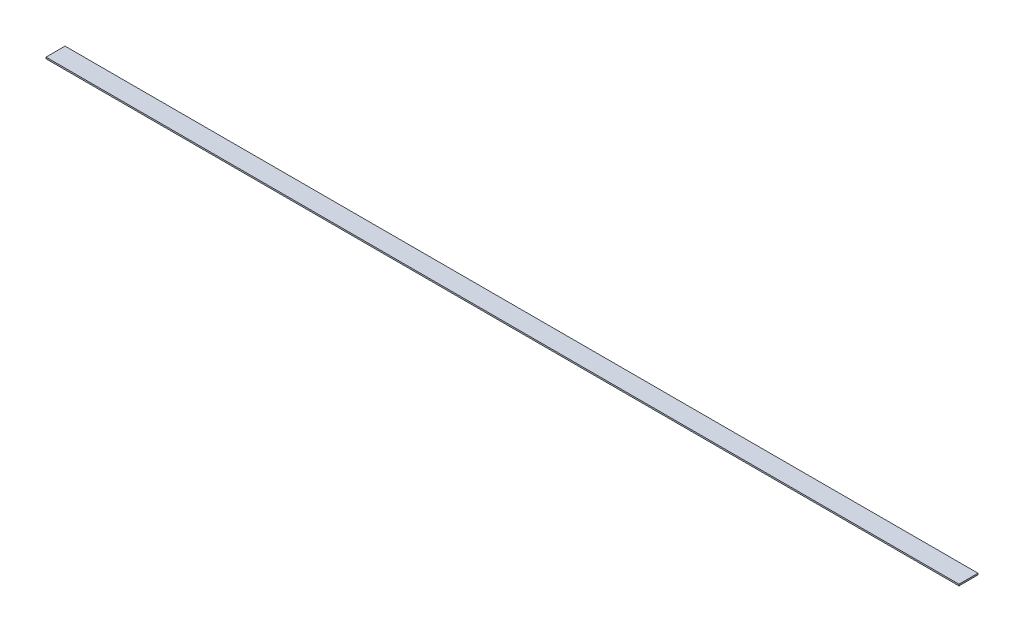
ISO-10303-21;
HEADER;
FILE_DESCRIPTION(('STEP AP214'),'2;1');
FILE_NAME('part.step','',(''),(''),'','','');
FILE_SCHEMA(('AUTOMOTIVE_DESIGN { 1 0 10303 214 1 1 1 1 }'));
ENDSEC;
DATA;
#1=APPLICATION_CONTEXT('core data for automotive mechanical design processes');
#2=APPLICATION_PROTOCOL_DEFINITION('international standard','automotive_design',2000,#1);
#3=PRODUCT_CONTEXT('',#1,'mechanical');
#4=PRODUCT('Part','Part','',(#3));
#5=PRODUCT_RELATED_PRODUCT_CATEGORY('part','',(#4));
#6=PRODUCT_DEFINITION_FORMATION('','',#4);
#7=PRODUCT_DEFINITION_CONTEXT('part definition',#1,'design');
#8=PRODUCT_DEFINITION('design','',#6,#7);
#9=PRODUCT_DEFINITION_SHAPE('','',#8);
#10=(LENGTH_UNIT() NAMED_UNIT(*) SI_UNIT(.MILLI.,.METRE.));
#11=(NAMED_UNIT(*) PLANE_ANGLE_UNIT() SI_UNIT($,.RADIAN.));
#12=(NAMED_UNIT(*) SI_UNIT($,.STERADIAN.) SOLID_ANGLE_UNIT());
#13=UNCERTAINTY_MEASURE_WITH_UNIT(LENGTH_MEASURE(1.E-05),#10,'distance_accuracy_value','');
#14=(GEOMETRIC_REPRESENTATION_CONTEXT(3) GLOBAL_UNCERTAINTY_ASSIGNED_CONTEXT((#13)) GLOBAL_UNIT_ASSIGNED_CONTEXT((#10,
#11,#12)) REPRESENTATION_CONTEXT('',''));
#15=CARTESIAN_POINT('',(0.,0.,0.));
#16=DIRECTION('',(0.,0.,1.));
#17=DIRECTION('',(1.,0.,0.));
#18=AXIS2_PLACEMENT_3D('',#15,#16,#17);
#19=CARTESIAN_POINT('',(-152.4,0.25,3.17500000000002));
#20=DIRECTION('',(1.,0.,0.));
#21=DIRECTION('',(0.,0.,-1.));
#22=AXIS2_PLACEMENT_3D('',#19,#20,#21);
#23=PLANE('',#22);
#24=DIRECTION('',(0.,0.,1.));
#25=VECTOR('',#24,1.);
#26=CARTESIAN_POINT('',(-152.4,-0.25,3.17500000000002));
#27=LINE('',#26,#25);
#28=CARTESIAN_POINT('',(-152.4,-0.25,-3.17499999999998));
#29=VERTEX_POINT('',#28);
#30=CARTESIAN_POINT('',(-152.4,-0.25,3.17500000000002));
#31=VERTEX_POINT('',#30);
#32=EDGE_CURVE('E107',#29,#31,#27,.T.);
#33=ORIENTED_EDGE('',*,*,#32,.T.);
#34=DIRECTION('',(0.,-1.,0.));
#35=VECTOR('',#34,1.);
#36=CARTESIAN_POINT('',(-152.4,0.25,3.17500000000002));
#37=LINE('',#36,#35);
#38=CARTESIAN_POINT('',(-152.4,0.25,3.17500000000002));
#39=VERTEX_POINT('',#38);
#40=EDGE_CURVE('E11',#39,#31,#37,.T.);
#41=ORIENTED_EDGE('',*,*,#40,.F.);
#42=DIRECTION('',(0.,0.,1.));
#43=VECTOR('',#42,1.);
#44=CARTESIAN_POINT('',(-152.4,0.25,3.17500000000002));
#45=LINE('',#44,#43);
#46=CARTESIAN_POINT('',(-152.4,0.25,-3.17499999999998));
#47=VERTEX_POINT('',#46);
#48=EDGE_CURVE('E91',#47,#39,#45,.T.);
#49=ORIENTED_EDGE('',*,*,#48,.F.);
#50=DIRECTION('',(0.,-1.,0.));
#51=VECTOR('',#50,1.);
#52=CARTESIAN_POINT('',(-152.4,0.25,-3.17499999999998));
#53=LINE('',#52,#51);
#54=EDGE_CURVE('E103',#47,#29,#53,.T.);
#55=ORIENTED_EDGE('',*,*,#54,.T.);
#56=EDGE_LOOP('',(#33,#41,#49,#55));
#57=FACE_BOUND('',#56,.T.);
#58=ADVANCED_FACE('F39',(#57),#23,.F.);
#59=CARTESIAN_POINT('',(152.4,0.25,3.17499999999998));
#60=DIRECTION('',(0.,0.,-1.));
#61=DIRECTION('',(-1.,0.,0.));
#62=AXIS2_PLACEMENT_3D('',#59,#60,#61);
#63=PLANE('',#62);
#64=DIRECTION('',(1.,0.,0.));
#65=VECTOR('',#64,1.);
#66=CARTESIAN_POINT('',(152.4,-0.25,3.17499999999998));
#67=LINE('',#66,#65);
#68=CARTESIAN_POINT('',(152.4,-0.25,3.17499999999998));
#69=VERTEX_POINT('',#68);
#70=EDGE_CURVE('E96',#31,#69,#67,.T.);
#71=ORIENTED_EDGE('',*,*,#70,.T.);
#72=DIRECTION('',(0.,-1.,0.));
#73=VECTOR('',#72,1.);
#74=CARTESIAN_POINT('',(152.4,0.25,3.17499999999998));
#75=LINE('',#74,#73);
#76=CARTESIAN_POINT('',(152.4,0.25,3.17499999999998));
#77=VERTEX_POINT('',#76);
#78=EDGE_CURVE('E48',#77,#69,#75,.T.);
#79=ORIENTED_EDGE('',*,*,#78,.F.);
#80=DIRECTION('',(1.,0.,0.));
#81=VECTOR('',#80,1.);
#82=CARTESIAN_POINT('',(152.4,0.25,3.17499999999998));
#83=LINE('',#82,#81);
#84=EDGE_CURVE('E86',#39,#77,#83,.T.);
#85=ORIENTED_EDGE('',*,*,#84,.F.);
#86=ORIENTED_EDGE('',*,*,#40,.T.);
#87=EDGE_LOOP('',(#71,#79,#85,#86));
#88=FACE_BOUND('',#87,.T.);
#89=ADVANCED_FACE('F95',(#88),#63,.F.);
#90=CARTESIAN_POINT('',(152.4,0.25,3.17499999999998));
#91=DIRECTION('',(-1.,0.,0.));
#92=DIRECTION('',(0.,0.,1.));
#93=AXIS2_PLACEMENT_3D('',#90,#91,#92);
#94=PLANE('',#93);
#95=DIRECTION('',(0.,0.,-1.));
#96=VECTOR('',#95,1.);
#97=CARTESIAN_POINT('',(152.4,-0.25,3.17499999999998));
#98=LINE('',#97,#96);
#99=CARTESIAN_POINT('',(152.4,-0.25,-3.17500000000002));
#100=VERTEX_POINT('',#99);
#101=EDGE_CURVE('E73',#69,#100,#98,.T.);
#102=ORIENTED_EDGE('',*,*,#101,.T.);
#103=DIRECTION('',(0.,-1.,0.));
#104=VECTOR('',#103,1.);
#105=CARTESIAN_POINT('',(152.4,0.25,-3.17500000000002));
#106=LINE('',#105,#104);
#107=CARTESIAN_POINT('',(152.4,0.25,-3.17500000000002));
#108=VERTEX_POINT('',#107);
#109=EDGE_CURVE('E98',#108,#100,#106,.T.);
#110=ORIENTED_EDGE('',*,*,#109,.F.);
#111=DIRECTION('',(0.,0.,-1.));
#112=VECTOR('',#111,1.);
#113=CARTESIAN_POINT('',(152.4,0.25,3.17499999999998));
#114=LINE('',#113,#112);
#115=EDGE_CURVE('E89',#77,#108,#114,.T.);
#116=ORIENTED_EDGE('',*,*,#115,.F.);
#117=ORIENTED_EDGE('',*,*,#78,.T.);
#118=EDGE_LOOP('',(#102,#110,#116,#117));
#119=FACE_BOUND('',#118,.T.);
#120=ADVANCED_FACE('F99',(#119),#94,.F.);
#121=CARTESIAN_POINT('',(152.4,0.25,-3.17500000000002));
#122=DIRECTION('',(0.,0.,1.));
#123=DIRECTION('',(1.,0.,0.));
#124=AXIS2_PLACEMENT_3D('',#121,#122,#123);
#125=PLANE('',#124);
#126=DIRECTION('',(-1.,0.,0.));
#127=VECTOR('',#126,1.);
#128=CARTESIAN_POINT('',(152.4,-0.25,-3.17500000000002));
#129=LINE('',#128,#127);
#130=EDGE_CURVE('E79',#100,#29,#129,.T.);
#131=ORIENTED_EDGE('',*,*,#130,.T.);
#132=ORIENTED_EDGE('',*,*,#54,.F.);
#133=DIRECTION('',(-1.,0.,0.));
#134=VECTOR('',#133,1.);
#135=CARTESIAN_POINT('',(152.4,0.25,-3.17500000000002));
#136=LINE('',#135,#134);
#137=EDGE_CURVE('E56',#108,#47,#136,.T.);
#138=ORIENTED_EDGE('',*,*,#137,.F.);
#139=ORIENTED_EDGE('',*,*,#109,.T.);
#140=EDGE_LOOP('',(#131,#132,#138,#139));
#141=FACE_BOUND('',#140,.T.);
#142=ADVANCED_FACE('F120',(#141),#125,.F.);
#143=CARTESIAN_POINT('',(0.,0.25,0.));
#144=DIRECTION('',(0.,1.,0.));
#145=DIRECTION('',(0.,0.,1.));
#146=AXIS2_PLACEMENT_3D('',#143,#144,#145);
#147=PLANE('',#146);
#148=ORIENTED_EDGE('',*,*,#48,.T.);
#149=ORIENTED_EDGE('',*,*,#84,.T.);
#150=ORIENTED_EDGE('',*,*,#115,.T.);
#151=ORIENTED_EDGE('',*,*,#137,.T.);
#152=EDGE_LOOP('',(#148,#149,#150,#151));
#153=FACE_BOUND('',#152,.T.);
#154=ADVANCED_FACE('F87',(#153),#147,.T.);
#155=CARTESIAN_POINT('',(0.,-0.25,0.));
#156=DIRECTION('',(0.,1.,0.));
#157=DIRECTION('',(0.,0.,1.));
#158=AXIS2_PLACEMENT_3D('',#155,#156,#157);
#159=PLANE('',#158);
#160=ORIENTED_EDGE('',*,*,#32,.F.);
#161=ORIENTED_EDGE('',*,*,#130,.F.);
#162=ORIENTED_EDGE('',*,*,#101,.F.);
#163=ORIENTED_EDGE('',*,*,#70,.F.);
#164=EDGE_LOOP('',(#160,#161,#162,#163));
#165=FACE_BOUND('',#164,.T.);
#166=ADVANCED_FACE('F123',(#165),#159,.F.);
#167=CLOSED_SHELL('',(#58,#89,#120,#142,#154,#166));
#168=MANIFOLD_SOLID_BREP('B2',#167);
#169=ADVANCED_BREP_SHAPE_REPRESENTATION('',(#18,#168),#14);
#170=SHAPE_DEFINITION_REPRESENTATION(#9,#169);
ENDSEC;
END-ISO-10303-21;
